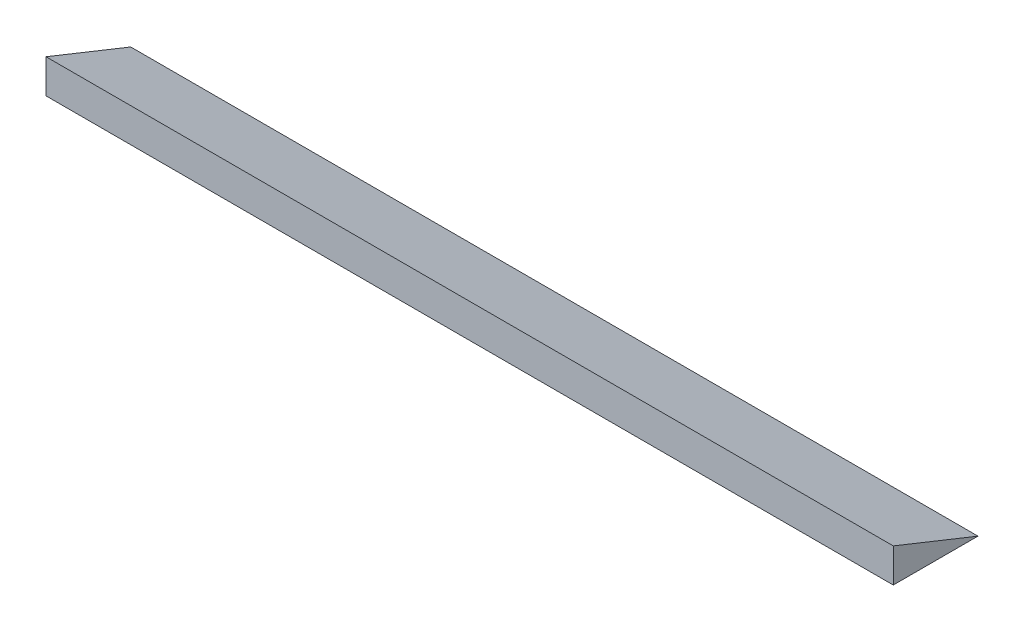
ISO-10303-21;
HEADER;
FILE_DESCRIPTION(('STEP AP214'),'2;1');
FILE_NAME('part.step','',(''),(''),'','','');
FILE_SCHEMA(('AUTOMOTIVE_DESIGN { 1 0 10303 214 1 1 1 1 }'));
ENDSEC;
DATA;
#1=APPLICATION_CONTEXT('core data for automotive mechanical design processes');
#2=APPLICATION_PROTOCOL_DEFINITION('international standard','automotive_design',2000,#1);
#3=PRODUCT_CONTEXT('',#1,'mechanical');
#4=PRODUCT('Part','Part','',(#3));
#5=PRODUCT_RELATED_PRODUCT_CATEGORY('part','',(#4));
#6=PRODUCT_DEFINITION_FORMATION('','',#4);
#7=PRODUCT_DEFINITION_CONTEXT('part definition',#1,'design');
#8=PRODUCT_DEFINITION('design','',#6,#7);
#9=PRODUCT_DEFINITION_SHAPE('','',#8);
#10=(LENGTH_UNIT() NAMED_UNIT(*) SI_UNIT(.MILLI.,.METRE.));
#11=(NAMED_UNIT(*) PLANE_ANGLE_UNIT() SI_UNIT($,.RADIAN.));
#12=(NAMED_UNIT(*) SI_UNIT($,.STERADIAN.) SOLID_ANGLE_UNIT());
#13=UNCERTAINTY_MEASURE_WITH_UNIT(LENGTH_MEASURE(1.E-05),#10,'distance_accuracy_value','');
#14=(GEOMETRIC_REPRESENTATION_CONTEXT(3) GLOBAL_UNCERTAINTY_ASSIGNED_CONTEXT((#13)) GLOBAL_UNIT_ASSIGNED_CONTEXT((#10,
#11,#12)) REPRESENTATION_CONTEXT('',''));
#15=CARTESIAN_POINT('',(0.,0.,0.));
#16=DIRECTION('',(0.,0.,1.));
#17=DIRECTION('',(1.,0.,0.));
#18=AXIS2_PLACEMENT_3D('',#15,#16,#17);
#19=CARTESIAN_POINT('',(1000.,40.,0.));
#20=DIRECTION('',(0.,0.,-1.));
#21=DIRECTION('',(0.,1.,0.));
#22=AXIS2_PLACEMENT_3D('',#19,#20,#21);
#23=PLANE('',#22);
#24=DIRECTION('',(0.,-1.,0.));
#25=VECTOR('',#24,1.);
#26=CARTESIAN_POINT('',(0.,40.,0.));
#27=LINE('',#26,#25);
#28=CARTESIAN_POINT('',(0.,40.,0.));
#29=VERTEX_POINT('',#28);
#30=CARTESIAN_POINT('',(0.,0.,0.));
#31=VERTEX_POINT('',#30);
#32=EDGE_CURVE('E80',#29,#31,#27,.T.);
#33=ORIENTED_EDGE('',*,*,#32,.T.);
#34=DIRECTION('',(-1.,0.,0.));
#35=VECTOR('',#34,1.);
#36=CARTESIAN_POINT('',(1000.,0.,0.));
#37=LINE('',#36,#35);
#38=CARTESIAN_POINT('',(1000.,0.,0.));
#39=VERTEX_POINT('',#38);
#40=EDGE_CURVE('E11',#39,#31,#37,.T.);
#41=ORIENTED_EDGE('',*,*,#40,.F.);
#42=DIRECTION('',(0.,-1.,0.));
#43=VECTOR('',#42,1.);
#44=CARTESIAN_POINT('',(1000.,40.,0.));
#45=LINE('',#44,#43);
#46=CARTESIAN_POINT('',(1000.,40.,0.));
#47=VERTEX_POINT('',#46);
#48=EDGE_CURVE('E73',#47,#39,#45,.T.);
#49=ORIENTED_EDGE('',*,*,#48,.F.);
#50=DIRECTION('',(-1.,0.,0.));
#51=VECTOR('',#50,1.);
#52=CARTESIAN_POINT('',(1000.,40.,0.));
#53=LINE('',#52,#51);
#54=EDGE_CURVE('E81',#47,#29,#53,.T.);
#55=ORIENTED_EDGE('',*,*,#54,.T.);
#56=EDGE_LOOP('',(#33,#41,#49,#55));
#57=FACE_BOUND('',#56,.T.);
#58=ADVANCED_FACE('F33',(#57),#23,.F.);
#59=CARTESIAN_POINT('',(1000.,0.,0.));
#60=DIRECTION('',(0.,1.,0.));
#61=DIRECTION('',(0.,0.,1.));
#62=AXIS2_PLACEMENT_3D('',#59,#60,#61);
#63=PLANE('',#62);
#64=DIRECTION('',(0.,0.,-1.));
#65=VECTOR('',#64,1.);
#66=CARTESIAN_POINT('',(0.,0.,0.));
#67=LINE('',#66,#65);
#68=CARTESIAN_POINT('',(0.,0.,-100.));
#69=VERTEX_POINT('',#68);
#70=EDGE_CURVE('E61',#31,#69,#67,.T.);
#71=ORIENTED_EDGE('',*,*,#70,.T.);
#72=DIRECTION('',(-1.,0.,0.));
#73=VECTOR('',#72,1.);
#74=CARTESIAN_POINT('',(1000.,0.,-100.));
#75=LINE('',#74,#73);
#76=CARTESIAN_POINT('',(1000.,0.,-100.));
#77=VERTEX_POINT('',#76);
#78=EDGE_CURVE('E41',#77,#69,#75,.T.);
#79=ORIENTED_EDGE('',*,*,#78,.F.);
#80=DIRECTION('',(0.,0.,-1.));
#81=VECTOR('',#80,1.);
#82=CARTESIAN_POINT('',(1000.,0.,0.));
#83=LINE('',#82,#81);
#84=EDGE_CURVE('E69',#39,#77,#83,.T.);
#85=ORIENTED_EDGE('',*,*,#84,.F.);
#86=ORIENTED_EDGE('',*,*,#40,.T.);
#87=EDGE_LOOP('',(#71,#79,#85,#86));
#88=FACE_BOUND('',#87,.T.);
#89=ADVANCED_FACE('F70',(#88),#63,.F.);
#90=CARTESIAN_POINT('',(1000.,0.,-100.));
#91=DIRECTION('',(0.,-0.928476690885259,0.371390676354104));
#92=DIRECTION('',(0.,-0.371390676354104,-0.928476690885259));
#93=AXIS2_PLACEMENT_3D('',#90,#91,#92);
#94=PLANE('',#93);
#95=DIRECTION('',(0.,0.371390676354104,0.928476690885259));
#96=VECTOR('',#95,1.);
#97=CARTESIAN_POINT('',(0.,0.,-100.));
#98=LINE('',#97,#96);
#99=EDGE_CURVE('E66',#69,#29,#98,.T.);
#100=ORIENTED_EDGE('',*,*,#99,.T.);
#101=ORIENTED_EDGE('',*,*,#54,.F.);
#102=DIRECTION('',(0.,0.371390676354104,0.928476690885259));
#103=VECTOR('',#102,1.);
#104=CARTESIAN_POINT('',(1000.,0.,-100.));
#105=LINE('',#104,#103);
#106=EDGE_CURVE('E49',#77,#47,#105,.T.);
#107=ORIENTED_EDGE('',*,*,#106,.F.);
#108=ORIENTED_EDGE('',*,*,#78,.T.);
#109=EDGE_LOOP('',(#100,#101,#107,#108));
#110=FACE_BOUND('',#109,.T.);
#111=ADVANCED_FACE('F88',(#110),#94,.F.);
#112=CARTESIAN_POINT('',(1000.,0.,0.));
#113=DIRECTION('',(1.,0.,0.));
#114=DIRECTION('',(0.,0.,-1.));
#115=AXIS2_PLACEMENT_3D('',#112,#113,#114);
#116=PLANE('',#115);
#117=ORIENTED_EDGE('',*,*,#48,.T.);
#118=ORIENTED_EDGE('',*,*,#84,.T.);
#119=ORIENTED_EDGE('',*,*,#106,.T.);
#120=EDGE_LOOP('',(#117,#118,#119));
#121=FACE_BOUND('',#120,.T.);
#122=ADVANCED_FACE('F76',(#121),#116,.T.);
#123=CARTESIAN_POINT('',(0.,0.,0.));
#124=DIRECTION('',(1.,0.,0.));
#125=DIRECTION('',(0.,0.,-1.));
#126=AXIS2_PLACEMENT_3D('',#123,#124,#125);
#127=PLANE('',#126);
#128=ORIENTED_EDGE('',*,*,#32,.F.);
#129=ORIENTED_EDGE('',*,*,#99,.F.);
#130=ORIENTED_EDGE('',*,*,#70,.F.);
#131=EDGE_LOOP('',(#128,#129,#130));
#132=FACE_BOUND('',#131,.T.);
#133=ADVANCED_FACE('F89',(#132),#127,.F.);
#134=CLOSED_SHELL('',(#58,#89,#111,#122,#133));
#135=MANIFOLD_SOLID_BREP('B2',#134);
#136=ADVANCED_BREP_SHAPE_REPRESENTATION('',(#18,#135),#14);
#137=SHAPE_DEFINITION_REPRESENTATION(#9,#136);
ENDSEC;
END-ISO-10303-21;
